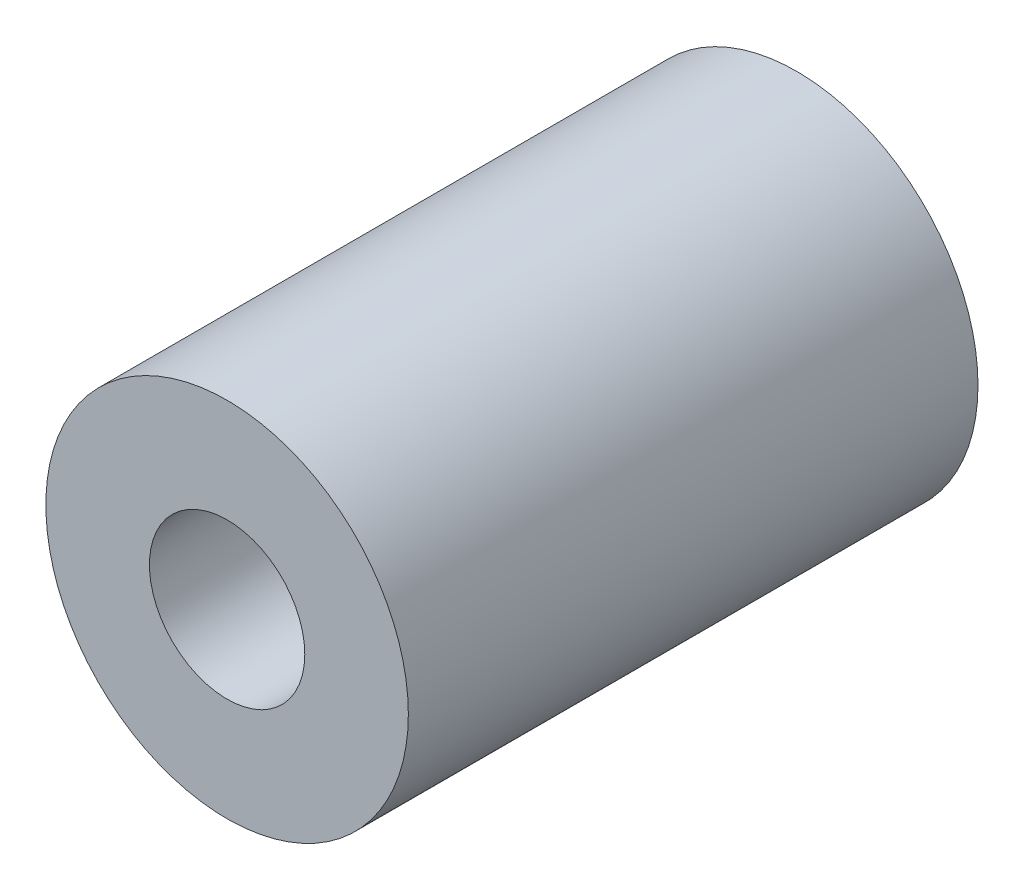
ISO-10303-21;
HEADER;
FILE_DESCRIPTION(('STEP AP214'),'2;1');
FILE_NAME('part.step','',(''),(''),'','','');
FILE_SCHEMA(('AUTOMOTIVE_DESIGN { 1 0 10303 214 1 1 1 1 }'));
ENDSEC;
DATA;
#1=APPLICATION_CONTEXT('core data for automotive mechanical design processes');
#2=APPLICATION_PROTOCOL_DEFINITION('international standard','automotive_design',2000,#1);
#3=PRODUCT_CONTEXT('',#1,'mechanical');
#4=PRODUCT('Part','Part','',(#3));
#5=PRODUCT_RELATED_PRODUCT_CATEGORY('part','',(#4));
#6=PRODUCT_DEFINITION_FORMATION('','',#4);
#7=PRODUCT_DEFINITION_CONTEXT('part definition',#1,'design');
#8=PRODUCT_DEFINITION('design','',#6,#7);
#9=PRODUCT_DEFINITION_SHAPE('','',#8);
#10=(LENGTH_UNIT() NAMED_UNIT(*) SI_UNIT(.MILLI.,.METRE.));
#11=(NAMED_UNIT(*) PLANE_ANGLE_UNIT() SI_UNIT($,.RADIAN.));
#12=(NAMED_UNIT(*) SI_UNIT($,.STERADIAN.) SOLID_ANGLE_UNIT());
#13=UNCERTAINTY_MEASURE_WITH_UNIT(LENGTH_MEASURE(1.E-05),#10,'distance_accuracy_value','');
#14=(GEOMETRIC_REPRESENTATION_CONTEXT(3) GLOBAL_UNCERTAINTY_ASSIGNED_CONTEXT((#13)) GLOBAL_UNIT_ASSIGNED_CONTEXT((#10,
#11,#12)) REPRESENTATION_CONTEXT('',''));
#15=CARTESIAN_POINT('',(0.,0.,0.));
#16=DIRECTION('',(0.,0.,1.));
#17=DIRECTION('',(1.,0.,0.));
#18=AXIS2_PLACEMENT_3D('',#15,#16,#17);
#19=CARTESIAN_POINT('',(0.,0.,22.));
#20=DIRECTION('',(0.,0.,-1.));
#21=DIRECTION('',(-1.,0.,0.));
#22=AXIS2_PLACEMENT_3D('',#19,#20,#21);
#23=CYLINDRICAL_SURFACE('',#22,7.);
#24=CARTESIAN_POINT('',(0.,0.,22.));
#25=DIRECTION('',(0.,0.,1.));
#26=DIRECTION('',(1.,0.,0.));
#27=AXIS2_PLACEMENT_3D('',#24,#25,#26);
#28=CIRCLE('',#27,7.);
#29=CARTESIAN_POINT('',(7.,0.,22.));
#30=VERTEX_POINT('',#29);
#31=EDGE_CURVE('E10',#30,#30,#28,.T.);
#32=ORIENTED_EDGE('',*,*,#31,.F.);
#33=EDGE_LOOP('',(#32));
#34=FACE_BOUND('',#33,.T.);
#35=CARTESIAN_POINT('',(0.,0.,0.));
#36=DIRECTION('',(0.,0.,1.));
#37=DIRECTION('',(1.,0.,0.));
#38=AXIS2_PLACEMENT_3D('',#35,#36,#37);
#39=CIRCLE('',#38,7.);
#40=CARTESIAN_POINT('',(7.,0.,0.));
#41=VERTEX_POINT('',#40);
#42=EDGE_CURVE('E36',#41,#41,#39,.T.);
#43=ORIENTED_EDGE('',*,*,#42,.T.);
#44=EDGE_LOOP('',(#43));
#45=FACE_BOUND('',#44,.T.);
#46=ADVANCED_FACE('F33',(#34,#45),#23,.T.);
#47=CARTESIAN_POINT('',(0.,0.,22.));
#48=DIRECTION('',(0.,0.,1.));
#49=DIRECTION('',(1.,0.,0.));
#50=AXIS2_PLACEMENT_3D('',#47,#48,#49);
#51=PLANE('',#50);
#52=CARTESIAN_POINT('',(0.,0.,22.));
#53=DIRECTION('',(0.,0.,1.));
#54=DIRECTION('',(1.,0.,0.));
#55=AXIS2_PLACEMENT_3D('',#52,#53,#54);
#56=CIRCLE('',#55,3.);
#57=CARTESIAN_POINT('',(3.,0.,22.));
#58=VERTEX_POINT('',#57);
#59=EDGE_CURVE('E45',#58,#58,#56,.T.);
#60=ORIENTED_EDGE('',*,*,#59,.F.);
#61=EDGE_LOOP('',(#60));
#62=FACE_BOUND('',#61,.T.);
#63=ORIENTED_EDGE('',*,*,#31,.T.);
#64=EDGE_LOOP('',(#63));
#65=FACE_BOUND('',#64,.T.);
#66=ADVANCED_FACE('F60',(#62,#65),#51,.T.);
#67=CARTESIAN_POINT('',(0.,0.,0.));
#68=DIRECTION('',(0.,0.,1.));
#69=DIRECTION('',(1.,0.,0.));
#70=AXIS2_PLACEMENT_3D('',#67,#68,#69);
#71=PLANE('',#70);
#72=CARTESIAN_POINT('',(0.,0.,0.));
#73=DIRECTION('',(0.,0.,1.));
#74=DIRECTION('',(1.,0.,0.));
#75=AXIS2_PLACEMENT_3D('',#72,#73,#74);
#76=CIRCLE('',#75,3.);
#77=CARTESIAN_POINT('',(3.,0.,0.));
#78=VERTEX_POINT('',#77);
#79=EDGE_CURVE('E43',#78,#78,#76,.T.);
#80=ORIENTED_EDGE('',*,*,#79,.T.);
#81=EDGE_LOOP('',(#80));
#82=FACE_BOUND('',#81,.T.);
#83=ORIENTED_EDGE('',*,*,#42,.F.);
#84=EDGE_LOOP('',(#83));
#85=FACE_BOUND('',#84,.T.);
#86=ADVANCED_FACE('F51',(#82,#85),#71,.F.);
#87=CARTESIAN_POINT('',(0.,0.,0.));
#88=DIRECTION('',(0.,0.,1.));
#89=DIRECTION('',(1.,0.,0.));
#90=AXIS2_PLACEMENT_3D('',#87,#88,#89);
#91=CYLINDRICAL_SURFACE('',#90,3.);
#92=ORIENTED_EDGE('',*,*,#79,.F.);
#93=EDGE_LOOP('',(#92));
#94=FACE_BOUND('',#93,.T.);
#95=ORIENTED_EDGE('',*,*,#59,.T.);
#96=EDGE_LOOP('',(#95));
#97=FACE_BOUND('',#96,.T.);
#98=ADVANCED_FACE('F54',(#94,#97),#91,.F.);
#99=CLOSED_SHELL('',(#46,#66,#86,#98));
#100=MANIFOLD_SOLID_BREP('B2',#99);
#101=ADVANCED_BREP_SHAPE_REPRESENTATION('',(#18,#100),#14);
#102=SHAPE_DEFINITION_REPRESENTATION(#9,#101);
ENDSEC;
END-ISO-10303-21;
